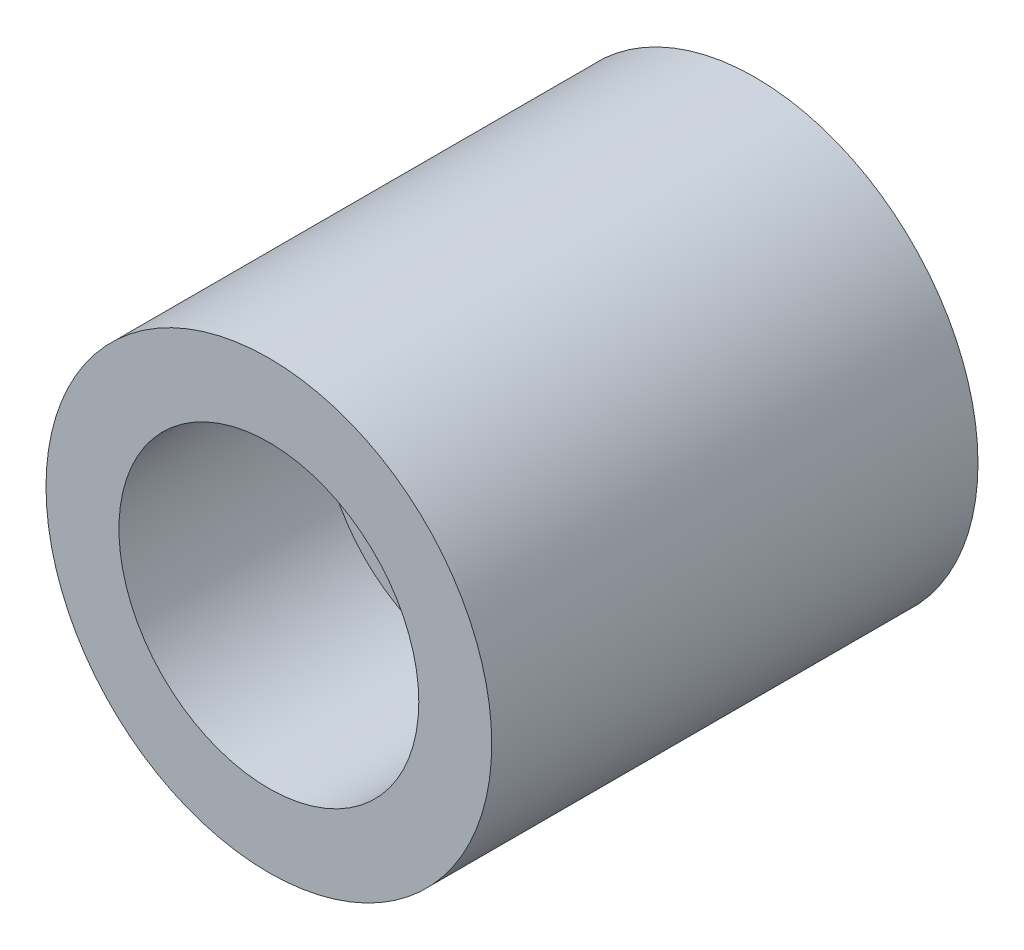
ISO-10303-21;
HEADER;
FILE_DESCRIPTION(('STEP AP214'),'2;1');
FILE_NAME('part.step','',(''),(''),'','','');
FILE_SCHEMA(('AUTOMOTIVE_DESIGN { 1 0 10303 214 1 1 1 1 }'));
ENDSEC;
DATA;
#1=APPLICATION_CONTEXT('core data for automotive mechanical design processes');
#2=APPLICATION_PROTOCOL_DEFINITION('international standard','automotive_design',2000,#1);
#3=PRODUCT_CONTEXT('',#1,'mechanical');
#4=PRODUCT('Part','Part','',(#3));
#5=PRODUCT_RELATED_PRODUCT_CATEGORY('part','',(#4));
#6=PRODUCT_DEFINITION_FORMATION('','',#4);
#7=PRODUCT_DEFINITION_CONTEXT('part definition',#1,'design');
#8=PRODUCT_DEFINITION('design','',#6,#7);
#9=PRODUCT_DEFINITION_SHAPE('','',#8);
#10=(LENGTH_UNIT() NAMED_UNIT(*) SI_UNIT(.MILLI.,.METRE.));
#11=(NAMED_UNIT(*) PLANE_ANGLE_UNIT() SI_UNIT($,.RADIAN.));
#12=(NAMED_UNIT(*) SI_UNIT($,.STERADIAN.) SOLID_ANGLE_UNIT());
#13=UNCERTAINTY_MEASURE_WITH_UNIT(LENGTH_MEASURE(1.E-05),#10,'distance_accuracy_value','');
#14=(GEOMETRIC_REPRESENTATION_CONTEXT(3) GLOBAL_UNCERTAINTY_ASSIGNED_CONTEXT((#13)) GLOBAL_UNIT_ASSIGNED_CONTEXT((#10,
#11,#12)) REPRESENTATION_CONTEXT('',''));
#15=CARTESIAN_POINT('',(0.,0.,0.));
#16=DIRECTION('',(0.,0.,1.));
#17=DIRECTION('',(1.,0.,0.));
#18=AXIS2_PLACEMENT_3D('',#15,#16,#17);
#19=CARTESIAN_POINT('',(0.,0.,6.));
#20=DIRECTION('',(0.,0.,-1.));
#21=DIRECTION('',(-1.,0.,0.));
#22=AXIS2_PLACEMENT_3D('',#19,#20,#21);
#23=CYLINDRICAL_SURFACE('',#22,2.75);
#24=CARTESIAN_POINT('',(0.,0.,6.));
#25=DIRECTION('',(0.,0.,1.));
#26=DIRECTION('',(1.,0.,0.));
#27=AXIS2_PLACEMENT_3D('',#24,#25,#26);
#28=CIRCLE('',#27,2.75);
#29=CARTESIAN_POINT('',(2.75,0.,6.));
#30=VERTEX_POINT('',#29);
#31=EDGE_CURVE('E10',#30,#30,#28,.T.);
#32=ORIENTED_EDGE('',*,*,#31,.F.);
#33=EDGE_LOOP('',(#32));
#34=FACE_BOUND('',#33,.T.);
#35=CARTESIAN_POINT('',(0.,0.,0.));
#36=DIRECTION('',(0.,0.,1.));
#37=DIRECTION('',(1.,0.,0.));
#38=AXIS2_PLACEMENT_3D('',#35,#36,#37);
#39=CIRCLE('',#38,2.75);
#40=CARTESIAN_POINT('',(2.75,0.,0.));
#41=VERTEX_POINT('',#40);
#42=EDGE_CURVE('E34',#41,#41,#39,.T.);
#43=ORIENTED_EDGE('',*,*,#42,.T.);
#44=EDGE_LOOP('',(#43));
#45=FACE_BOUND('',#44,.T.);
#46=ADVANCED_FACE('F31',(#34,#45),#23,.T.);
#47=CARTESIAN_POINT('',(0.,0.,6.));
#48=DIRECTION('',(0.,0.,1.));
#49=DIRECTION('',(1.,0.,0.));
#50=AXIS2_PLACEMENT_3D('',#47,#48,#49);
#51=PLANE('',#50);
#52=CARTESIAN_POINT('',(0.,0.,6.));
#53=DIRECTION('',(0.,0.,1.));
#54=DIRECTION('',(1.,0.,0.));
#55=AXIS2_PLACEMENT_3D('',#52,#53,#54);
#56=CIRCLE('',#55,1.85);
#57=CARTESIAN_POINT('',(1.85,0.,6.));
#58=VERTEX_POINT('',#57);
#59=EDGE_CURVE('E43',#58,#58,#56,.T.);
#60=ORIENTED_EDGE('',*,*,#59,.F.);
#61=EDGE_LOOP('',(#60));
#62=FACE_BOUND('',#61,.T.);
#63=ORIENTED_EDGE('',*,*,#31,.T.);
#64=EDGE_LOOP('',(#63));
#65=FACE_BOUND('',#64,.T.);
#66=ADVANCED_FACE('F58',(#62,#65),#51,.T.);
#67=CARTESIAN_POINT('',(0.,0.,0.));
#68=DIRECTION('',(0.,0.,1.));
#69=DIRECTION('',(1.,0.,0.));
#70=AXIS2_PLACEMENT_3D('',#67,#68,#69);
#71=PLANE('',#70);
#72=ORIENTED_EDGE('',*,*,#42,.F.);
#73=EDGE_LOOP('',(#72));
#74=FACE_BOUND('',#73,.T.);
#75=ADVANCED_FACE('F54',(#74),#71,.F.);
#76=CARTESIAN_POINT('',(0.,0.,3.5));
#77=DIRECTION('',(0.,0.,1.));
#78=DIRECTION('',(1.,0.,0.));
#79=AXIS2_PLACEMENT_3D('',#76,#77,#78);
#80=CYLINDRICAL_SURFACE('',#79,1.85);
#81=CARTESIAN_POINT('',(0.,0.,3.5));
#82=DIRECTION('',(0.,0.,1.));
#83=DIRECTION('',(1.,0.,0.));
#84=AXIS2_PLACEMENT_3D('',#81,#82,#83);
#85=CIRCLE('',#84,1.85);
#86=CARTESIAN_POINT('',(1.85,0.,3.5));
#87=VERTEX_POINT('',#86);
#88=EDGE_CURVE('E41',#87,#87,#85,.T.);
#89=ORIENTED_EDGE('',*,*,#88,.F.);
#90=EDGE_LOOP('',(#89));
#91=FACE_BOUND('',#90,.T.);
#92=ORIENTED_EDGE('',*,*,#59,.T.);
#93=EDGE_LOOP('',(#92));
#94=FACE_BOUND('',#93,.T.);
#95=ADVANCED_FACE('F51',(#91,#94),#80,.F.);
#96=CARTESIAN_POINT('',(0.,0.,3.5));
#97=DIRECTION('',(0.,0.,1.));
#98=DIRECTION('',(1.,0.,0.));
#99=AXIS2_PLACEMENT_3D('',#96,#97,#98);
#100=PLANE('',#99);
#101=ORIENTED_EDGE('',*,*,#88,.T.);
#102=EDGE_LOOP('',(#101));
#103=FACE_BOUND('',#102,.T.);
#104=ADVANCED_FACE('F49',(#103),#100,.T.);
#105=CLOSED_SHELL('',(#46,#66,#75,#95,#104));
#106=MANIFOLD_SOLID_BREP('B2',#105);
#107=ADVANCED_BREP_SHAPE_REPRESENTATION('',(#18,#106),#14);
#108=SHAPE_DEFINITION_REPRESENTATION(#9,#107);
ENDSEC;
END-ISO-10303-21;
